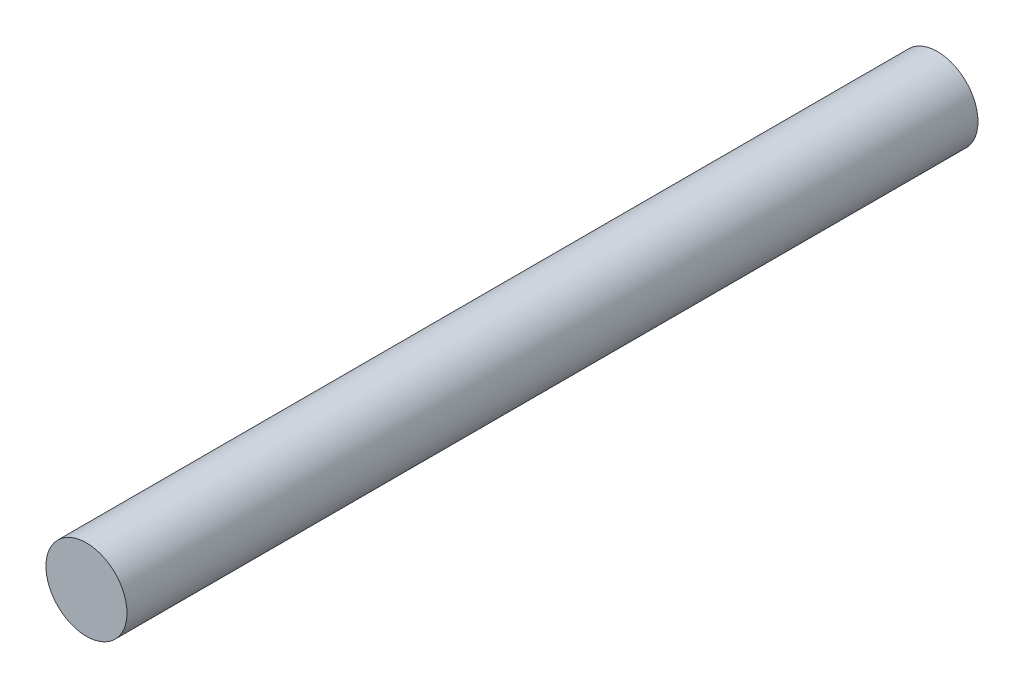
ISO-10303-21;
HEADER;
FILE_DESCRIPTION(('STEP AP214'),'2;1');
FILE_NAME('part.step','',(''),(''),'','','');
FILE_SCHEMA(('AUTOMOTIVE_DESIGN { 1 0 10303 214 1 1 1 1 }'));
ENDSEC;
DATA;
#1=APPLICATION_CONTEXT('core data for automotive mechanical design processes');
#2=APPLICATION_PROTOCOL_DEFINITION('international standard','automotive_design',2000,#1);
#3=PRODUCT_CONTEXT('',#1,'mechanical');
#4=PRODUCT('Part','Part','',(#3));
#5=PRODUCT_RELATED_PRODUCT_CATEGORY('part','',(#4));
#6=PRODUCT_DEFINITION_FORMATION('','',#4);
#7=PRODUCT_DEFINITION_CONTEXT('part definition',#1,'design');
#8=PRODUCT_DEFINITION('design','',#6,#7);
#9=PRODUCT_DEFINITION_SHAPE('','',#8);
#10=(LENGTH_UNIT() NAMED_UNIT(*) SI_UNIT(.MILLI.,.METRE.));
#11=(NAMED_UNIT(*) PLANE_ANGLE_UNIT() SI_UNIT($,.RADIAN.));
#12=(NAMED_UNIT(*) SI_UNIT($,.STERADIAN.) SOLID_ANGLE_UNIT());
#13=UNCERTAINTY_MEASURE_WITH_UNIT(LENGTH_MEASURE(1.E-05),#10,'distance_accuracy_value','');
#14=(GEOMETRIC_REPRESENTATION_CONTEXT(3) GLOBAL_UNCERTAINTY_ASSIGNED_CONTEXT((#13)) GLOBAL_UNIT_ASSIGNED_CONTEXT((#10,
#11,#12)) REPRESENTATION_CONTEXT('',''));
#15=CARTESIAN_POINT('',(0.,0.,0.));
#16=DIRECTION('',(0.,0.,1.));
#17=DIRECTION('',(1.,0.,0.));
#18=AXIS2_PLACEMENT_3D('',#15,#16,#17);
#19=CARTESIAN_POINT('',(0.,0.,10.5));
#20=DIRECTION('',(0.,0.,-1.));
#21=DIRECTION('',(-1.,0.,0.));
#22=AXIS2_PLACEMENT_3D('',#19,#20,#21);
#23=CYLINDRICAL_SURFACE('',#22,1.);
#24=CARTESIAN_POINT('',(0.,0.,10.5));
#25=DIRECTION('',(0.,0.,1.));
#26=DIRECTION('',(1.,0.,0.));
#27=AXIS2_PLACEMENT_3D('',#24,#25,#26);
#28=CIRCLE('',#27,1.);
#29=CARTESIAN_POINT('',(1.,0.,10.5));
#30=VERTEX_POINT('',#29);
#31=EDGE_CURVE('E10',#30,#30,#28,.T.);
#32=ORIENTED_EDGE('',*,*,#31,.F.);
#33=EDGE_LOOP('',(#32));
#34=FACE_BOUND('',#33,.T.);
#35=CARTESIAN_POINT('',(0.,0.,-10.5));
#36=DIRECTION('',(0.,0.,1.));
#37=DIRECTION('',(1.,0.,0.));
#38=AXIS2_PLACEMENT_3D('',#35,#36,#37);
#39=CIRCLE('',#38,1.);
#40=CARTESIAN_POINT('',(1.,0.,-10.5));
#41=VERTEX_POINT('',#40);
#42=EDGE_CURVE('E40',#41,#41,#39,.T.);
#43=ORIENTED_EDGE('',*,*,#42,.T.);
#44=EDGE_LOOP('',(#43));
#45=FACE_BOUND('',#44,.T.);
#46=ADVANCED_FACE('F37',(#34,#45),#23,.T.);
#47=CARTESIAN_POINT('',(0.,0.,10.5));
#48=DIRECTION('',(0.,0.,1.));
#49=DIRECTION('',(1.,0.,0.));
#50=AXIS2_PLACEMENT_3D('',#47,#48,#49);
#51=PLANE('',#50);
#52=ORIENTED_EDGE('',*,*,#31,.T.);
#53=EDGE_LOOP('',(#52));
#54=FACE_BOUND('',#53,.T.);
#55=ADVANCED_FACE('F54',(#54),#51,.T.);
#56=CARTESIAN_POINT('',(0.,0.,-10.5));
#57=DIRECTION('',(0.,0.,1.));
#58=DIRECTION('',(1.,0.,0.));
#59=AXIS2_PLACEMENT_3D('',#56,#57,#58);
#60=PLANE('',#59);
#61=ORIENTED_EDGE('',*,*,#42,.F.);
#62=EDGE_LOOP('',(#61));
#63=FACE_BOUND('',#62,.T.);
#64=ADVANCED_FACE('F52',(#63),#60,.F.);
#65=CLOSED_SHELL('',(#46,#55,#64));
#66=MANIFOLD_SOLID_BREP('B2',#65);
#67=ADVANCED_BREP_SHAPE_REPRESENTATION('',(#18,#66),#14);
#68=SHAPE_DEFINITION_REPRESENTATION(#9,#67);
ENDSEC;
END-ISO-10303-21;
